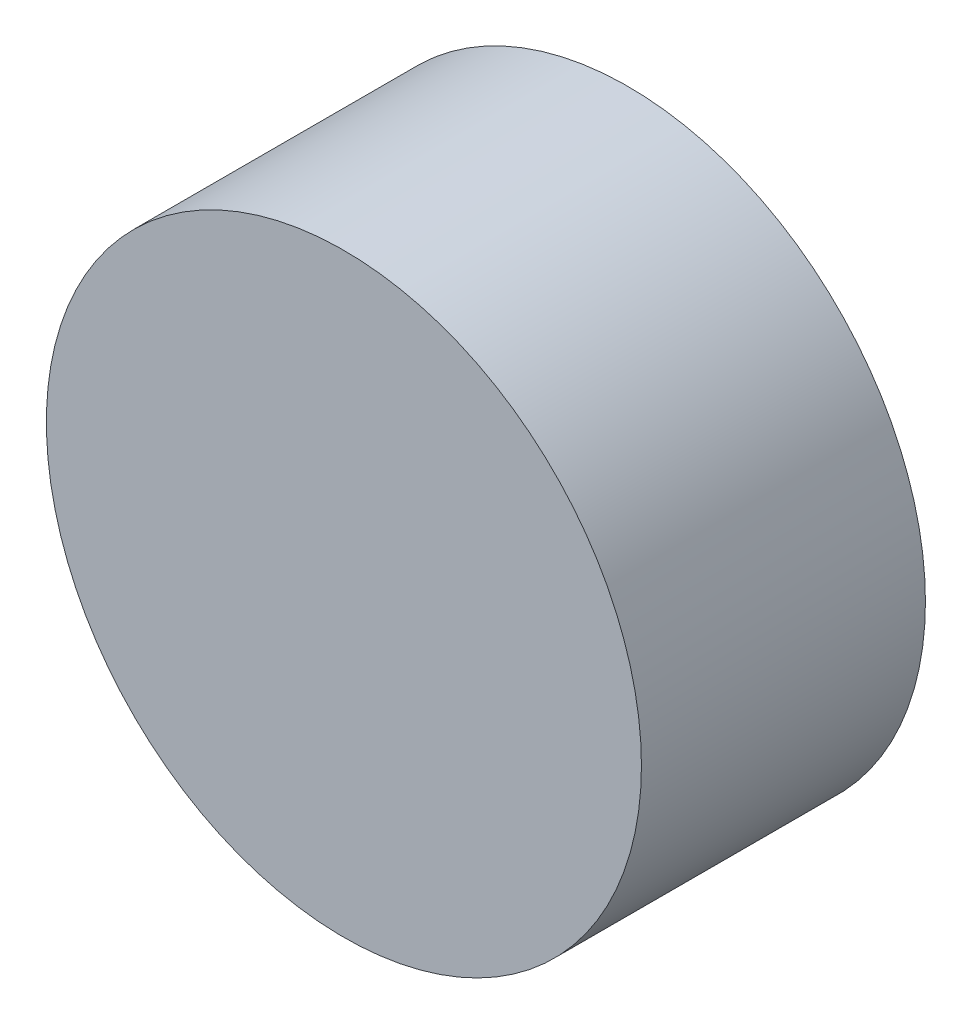
ISO-10303-21;
HEADER;
FILE_DESCRIPTION(('STEP AP214'),'2;1');
FILE_NAME('part.step','',(''),(''),'','','');
FILE_SCHEMA(('AUTOMOTIVE_DESIGN { 1 0 10303 214 1 1 1 1 }'));
ENDSEC;
DATA;
#1=APPLICATION_CONTEXT('core data for automotive mechanical design processes');
#2=APPLICATION_PROTOCOL_DEFINITION('international standard','automotive_design',2000,#1);
#3=PRODUCT_CONTEXT('',#1,'mechanical');
#4=PRODUCT('Part','Part','',(#3));
#5=PRODUCT_RELATED_PRODUCT_CATEGORY('part','',(#4));
#6=PRODUCT_DEFINITION_FORMATION('','',#4);
#7=PRODUCT_DEFINITION_CONTEXT('part definition',#1,'design');
#8=PRODUCT_DEFINITION('design','',#6,#7);
#9=PRODUCT_DEFINITION_SHAPE('','',#8);
#10=(LENGTH_UNIT() NAMED_UNIT(*) SI_UNIT(.MILLI.,.METRE.));
#11=(NAMED_UNIT(*) PLANE_ANGLE_UNIT() SI_UNIT($,.RADIAN.));
#12=(NAMED_UNIT(*) SI_UNIT($,.STERADIAN.) SOLID_ANGLE_UNIT());
#13=UNCERTAINTY_MEASURE_WITH_UNIT(LENGTH_MEASURE(1.E-05),#10,'distance_accuracy_value','');
#14=(GEOMETRIC_REPRESENTATION_CONTEXT(3) GLOBAL_UNCERTAINTY_ASSIGNED_CONTEXT((#13)) GLOBAL_UNIT_ASSIGNED_CONTEXT((#10,
#11,#12)) REPRESENTATION_CONTEXT('',''));
#15=CARTESIAN_POINT('',(0.,0.,0.));
#16=DIRECTION('',(0.,0.,1.));
#17=DIRECTION('',(1.,0.,0.));
#18=AXIS2_PLACEMENT_3D('',#15,#16,#17);
#19=CARTESIAN_POINT('',(0.,0.,33.3375));
#20=DIRECTION('',(0.,0.,-1.));
#21=DIRECTION('',(-1.,0.,0.));
#22=AXIS2_PLACEMENT_3D('',#19,#20,#21);
#23=CYLINDRICAL_SURFACE('',#22,34.925);
#24=CARTESIAN_POINT('',(0.,0.,33.3375));
#25=DIRECTION('',(0.,0.,1.));
#26=DIRECTION('',(1.,0.,0.));
#27=AXIS2_PLACEMENT_3D('',#24,#25,#26);
#28=CIRCLE('',#27,34.925);
#29=CARTESIAN_POINT('',(34.925,0.,33.3375));
#30=VERTEX_POINT('',#29);
#31=EDGE_CURVE('E10',#30,#30,#28,.T.);
#32=ORIENTED_EDGE('',*,*,#31,.F.);
#33=EDGE_LOOP('',(#32));
#34=FACE_BOUND('',#33,.T.);
#35=CARTESIAN_POINT('',(0.,0.,0.));
#36=DIRECTION('',(0.,0.,1.));
#37=DIRECTION('',(1.,0.,0.));
#38=AXIS2_PLACEMENT_3D('',#35,#36,#37);
#39=CIRCLE('',#38,34.925);
#40=CARTESIAN_POINT('',(34.925,0.,0.));
#41=VERTEX_POINT('',#40);
#42=EDGE_CURVE('E40',#41,#41,#39,.T.);
#43=ORIENTED_EDGE('',*,*,#42,.T.);
#44=EDGE_LOOP('',(#43));
#45=FACE_BOUND('',#44,.T.);
#46=ADVANCED_FACE('F37',(#34,#45),#23,.T.);
#47=CARTESIAN_POINT('',(0.,0.,33.3375));
#48=DIRECTION('',(0.,0.,1.));
#49=DIRECTION('',(1.,0.,0.));
#50=AXIS2_PLACEMENT_3D('',#47,#48,#49);
#51=PLANE('',#50);
#52=ORIENTED_EDGE('',*,*,#31,.T.);
#53=EDGE_LOOP('',(#52));
#54=FACE_BOUND('',#53,.T.);
#55=ADVANCED_FACE('F54',(#54),#51,.T.);
#56=CARTESIAN_POINT('',(0.,0.,0.));
#57=DIRECTION('',(0.,0.,1.));
#58=DIRECTION('',(1.,0.,0.));
#59=AXIS2_PLACEMENT_3D('',#56,#57,#58);
#60=PLANE('',#59);
#61=ORIENTED_EDGE('',*,*,#42,.F.);
#62=EDGE_LOOP('',(#61));
#63=FACE_BOUND('',#62,.T.);
#64=ADVANCED_FACE('F52',(#63),#60,.F.);
#65=CLOSED_SHELL('',(#46,#55,#64));
#66=MANIFOLD_SOLID_BREP('B2',#65);
#67=ADVANCED_BREP_SHAPE_REPRESENTATION('',(#18,#66),#14);
#68=SHAPE_DEFINITION_REPRESENTATION(#9,#67);
ENDSEC;
END-ISO-10303-21;
